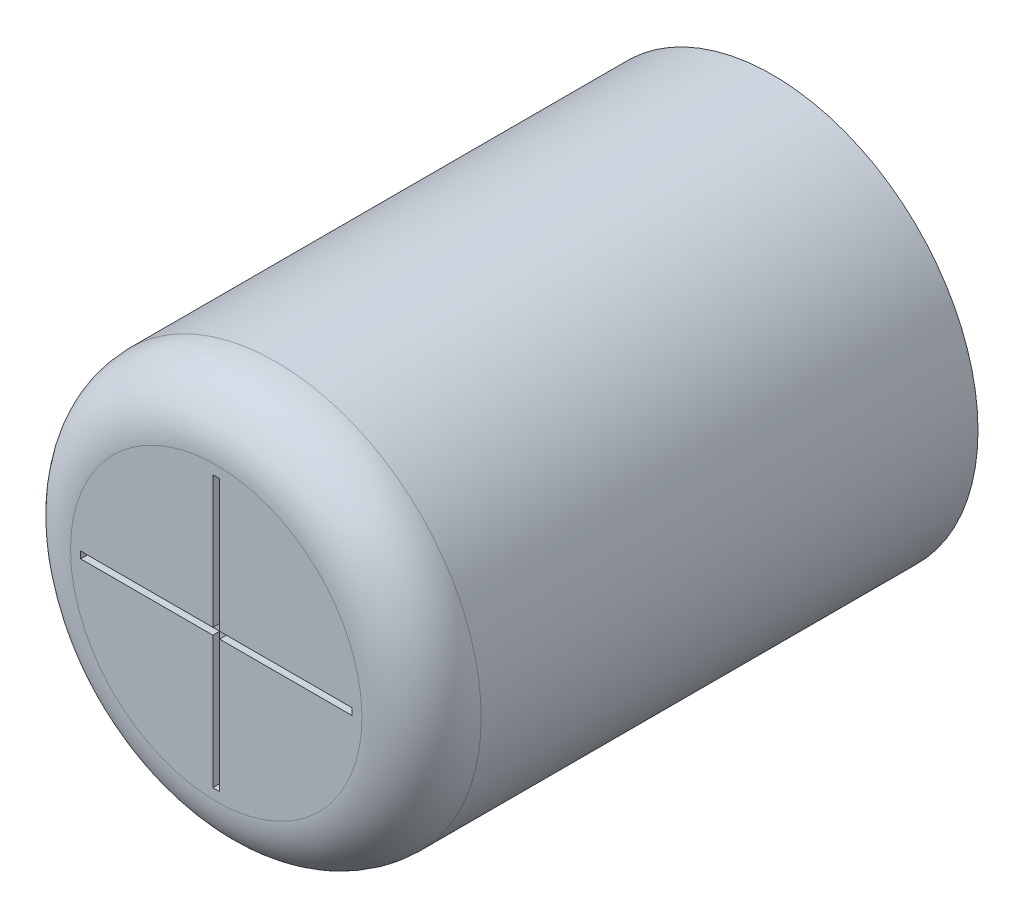
ISO-10303-21;
HEADER;
FILE_DESCRIPTION(('STEP AP214'),'2;1');
FILE_NAME('part.step','',(''),(''),'','','');
FILE_SCHEMA(('AUTOMOTIVE_DESIGN { 1 0 10303 214 1 1 1 1 }'));
ENDSEC;
DATA;
#1=APPLICATION_CONTEXT('core data for automotive mechanical design processes');
#2=APPLICATION_PROTOCOL_DEFINITION('international standard','automotive_design',2000,#1);
#3=PRODUCT_CONTEXT('',#1,'mechanical');
#4=PRODUCT('Part','Part','',(#3));
#5=PRODUCT_RELATED_PRODUCT_CATEGORY('part','',(#4));
#6=PRODUCT_DEFINITION_FORMATION('','',#4);
#7=PRODUCT_DEFINITION_CONTEXT('part definition',#1,'design');
#8=PRODUCT_DEFINITION('design','',#6,#7);
#9=PRODUCT_DEFINITION_SHAPE('','',#8);
#10=(LENGTH_UNIT() NAMED_UNIT(*) SI_UNIT(.MILLI.,.METRE.));
#11=(NAMED_UNIT(*) PLANE_ANGLE_UNIT() SI_UNIT($,.RADIAN.));
#12=(NAMED_UNIT(*) SI_UNIT($,.STERADIAN.) SOLID_ANGLE_UNIT());
#13=UNCERTAINTY_MEASURE_WITH_UNIT(LENGTH_MEASURE(1.E-05),#10,'distance_accuracy_value','');
#14=(GEOMETRIC_REPRESENTATION_CONTEXT(3) GLOBAL_UNCERTAINTY_ASSIGNED_CONTEXT((#13)) GLOBAL_UNIT_ASSIGNED_CONTEXT((#10,
#11,#12)) REPRESENTATION_CONTEXT('',''));
#15=CARTESIAN_POINT('',(0.,0.,0.));
#16=DIRECTION('',(0.,0.,1.));
#17=DIRECTION('',(1.,0.,0.));
#18=AXIS2_PLACEMENT_3D('',#15,#16,#17);
#19=CARTESIAN_POINT('',(-102.183303397109,-58.0021041199526,5.27999999850933));
#20=DIRECTION('',(0.,0.,1.));
#21=DIRECTION('',(1.,0.,0.));
#22=AXIS2_PLACEMENT_3D('',#19,#20,#21);
#23=PLANE('',#22);
#24=DIRECTION('',(0.,1.,0.));
#25=VECTOR('',#24,1.);
#26=CARTESIAN_POINT('',(-102.133303397109,-57.9521041199526,5.27999999850933));
#27=LINE('',#26,#25);
#28=CARTESIAN_POINT('',(-102.133303397109,-57.9521041199526,5.27999999850933));
#29=VERTEX_POINT('',#28);
#30=CARTESIAN_POINT('',(-102.133303397109,-56.0021041199526,5.27999999850933));
#31=VERTEX_POINT('',#30);
#32=EDGE_CURVE('E377',#29,#31,#27,.T.);
#33=ORIENTED_EDGE('',*,*,#32,.T.);
#34=DIRECTION('',(1.,0.,0.));
#35=VECTOR('',#34,1.);
#36=CARTESIAN_POINT('',(-102.133303397109,-56.0021041199526,5.27999999850933));
#37=LINE('',#36,#35);
#38=CARTESIAN_POINT('',(-102.233303397109,-56.0021041199526,5.27999999850933));
#39=VERTEX_POINT('',#38);
#40=EDGE_CURVE('E381',#31,#39,#37,.F.);
#41=ORIENTED_EDGE('',*,*,#40,.T.);
#42=DIRECTION('',(0.,1.,0.));
#43=VECTOR('',#42,1.);
#44=CARTESIAN_POINT('',(-102.233303397109,-56.0021041199526,5.27999999850933));
#45=LINE('',#44,#43);
#46=CARTESIAN_POINT('',(-102.233303397109,-57.9521041199526,5.27999999850933));
#47=VERTEX_POINT('',#46);
#48=EDGE_CURVE('E385',#39,#47,#45,.F.);
#49=ORIENTED_EDGE('',*,*,#48,.T.);
#50=DIRECTION('',(1.,0.,0.));
#51=VECTOR('',#50,1.);
#52=CARTESIAN_POINT('',(-102.233303397109,-57.9521041199526,5.27999999850933));
#53=LINE('',#52,#51);
#54=CARTESIAN_POINT('',(-104.183303397109,-57.9521041199526,5.27999999850933));
#55=VERTEX_POINT('',#54);
#56=EDGE_CURVE('E388',#47,#55,#53,.F.);
#57=ORIENTED_EDGE('',*,*,#56,.T.);
#58=DIRECTION('',(0.,1.,0.));
#59=VECTOR('',#58,1.);
#60=CARTESIAN_POINT('',(-104.183303397109,-57.9521041199526,5.27999999850933));
#61=LINE('',#60,#59);
#62=CARTESIAN_POINT('',(-104.183303397109,-58.0521041199526,5.27999999850933));
#63=VERTEX_POINT('',#62);
#64=EDGE_CURVE('E120',#55,#63,#61,.F.);
#65=ORIENTED_EDGE('',*,*,#64,.T.);
#66=DIRECTION('',(1.,0.,0.));
#67=VECTOR('',#66,1.);
#68=CARTESIAN_POINT('',(-104.183303397109,-58.0521041199526,5.27999999850933));
#69=LINE('',#68,#67);
#70=CARTESIAN_POINT('',(-102.233303397109,-58.0521041199526,5.27999999850933));
#71=VERTEX_POINT('',#70);
#72=EDGE_CURVE('E123',#63,#71,#69,.T.);
#73=ORIENTED_EDGE('',*,*,#72,.T.);
#74=DIRECTION('',(0.,1.,0.));
#75=VECTOR('',#74,1.);
#76=CARTESIAN_POINT('',(-102.233303397109,-58.0521041199526,5.27999999850933));
#77=LINE('',#76,#75);
#78=CARTESIAN_POINT('',(-102.233303397109,-60.0021041199526,5.27999999850933));
#79=VERTEX_POINT('',#78);
#80=EDGE_CURVE('E125',#71,#79,#77,.F.);
#81=ORIENTED_EDGE('',*,*,#80,.T.);
#82=DIRECTION('',(1.,0.,0.));
#83=VECTOR('',#82,1.);
#84=CARTESIAN_POINT('',(-102.183303397109,-60.0021041199526,5.27999999850933));
#85=LINE('',#84,#83);
#86=CARTESIAN_POINT('',(-102.133303397109,-60.0021041199526,5.27999999850933));
#87=VERTEX_POINT('',#86);
#88=EDGE_CURVE('E137',#79,#87,#85,.T.);
#89=ORIENTED_EDGE('',*,*,#88,.T.);
#90=DIRECTION('',(0.,1.,0.));
#91=VECTOR('',#90,1.);
#92=CARTESIAN_POINT('',(-102.133303397109,-60.0021041199526,5.27999999850933));
#93=LINE('',#92,#91);
#94=CARTESIAN_POINT('',(-102.133303397109,-58.0521041199526,5.27999999850933));
#95=VERTEX_POINT('',#94);
#96=EDGE_CURVE('E361',#87,#95,#93,.T.);
#97=ORIENTED_EDGE('',*,*,#96,.T.);
#98=DIRECTION('',(1.,0.,0.));
#99=VECTOR('',#98,1.);
#100=CARTESIAN_POINT('',(-102.133303397109,-58.0521041199526,5.27999999850933));
#101=LINE('',#100,#99);
#102=CARTESIAN_POINT('',(-100.183303397109,-58.0521041199526,5.27999999850933));
#103=VERTEX_POINT('',#102);
#104=EDGE_CURVE('E365',#95,#103,#101,.T.);
#105=ORIENTED_EDGE('',*,*,#104,.T.);
#106=DIRECTION('',(0.,1.,0.));
#107=VECTOR('',#106,1.);
#108=CARTESIAN_POINT('',(-100.183303397109,-58.0521041199526,5.27999999850933));
#109=LINE('',#108,#107);
#110=CARTESIAN_POINT('',(-100.183303397109,-57.9521041199526,5.27999999850933));
#111=VERTEX_POINT('',#110);
#112=EDGE_CURVE('E369',#103,#111,#109,.T.);
#113=ORIENTED_EDGE('',*,*,#112,.T.);
#114=DIRECTION('',(1.,0.,0.));
#115=VECTOR('',#114,1.);
#116=CARTESIAN_POINT('',(-100.183303397109,-57.9521041199526,5.27999999850933));
#117=LINE('',#116,#115);
#118=EDGE_CURVE('E373',#111,#29,#117,.F.);
#119=ORIENTED_EDGE('',*,*,#118,.T.);
#120=EDGE_LOOP('',(#33,#41,#49,#57,#65,#73,#81,#89,#97,#105,#113,#119));
#121=FACE_BOUND('',#120,.T.);
#122=ADVANCED_FACE('F17',(#121),#23,.T.);
#123=CARTESIAN_POINT('',(-102.233303397109,-58.0521041199526,5.37999999999944));
#124=DIRECTION('',(-1.,0.,0.));
#125=DIRECTION('',(0.,0.,1.));
#126=AXIS2_PLACEMENT_3D('',#123,#124,#125);
#127=PLANE('',#126);
#128=DIRECTION('',(0.,1.,0.));
#129=VECTOR('',#128,1.);
#130=CARTESIAN_POINT('',(-102.233303397109,-58.0021041199525,5.3799999999994));
#131=LINE('',#130,#129);
#132=CARTESIAN_POINT('',(-102.233303397109,-60.0021041199526,5.37999999999942));
#133=VERTEX_POINT('',#132);
#134=CARTESIAN_POINT('',(-102.233303397109,-58.0521041199526,5.37999999999942));
#135=VERTEX_POINT('',#134);
#136=EDGE_CURVE('E352',#133,#135,#131,.T.);
#137=ORIENTED_EDGE('',*,*,#136,.F.);
#138=DIRECTION('',(0.,0.,-1.));
#139=VECTOR('',#138,1.);
#140=CARTESIAN_POINT('',(-102.233303397109,-60.0021041199526,5.37999999999944));
#141=LINE('',#140,#139);
#142=EDGE_CURVE('E136',#133,#79,#141,.T.);
#143=ORIENTED_EDGE('',*,*,#142,.T.);
#144=ORIENTED_EDGE('',*,*,#80,.F.);
#145=DIRECTION('',(0.,0.,-1.));
#146=VECTOR('',#145,1.);
#147=CARTESIAN_POINT('',(-102.233303397109,-58.0521041199526,5.37999999999944));
#148=LINE('',#147,#146);
#149=EDGE_CURVE('E130',#71,#135,#148,.F.);
#150=ORIENTED_EDGE('',*,*,#149,.T.);
#151=EDGE_LOOP('',(#137,#143,#144,#150));
#152=FACE_BOUND('',#151,.T.);
#153=ADVANCED_FACE('F133',(#152),#127,.F.);
#154=CARTESIAN_POINT('',(-104.183303397109,-58.0521041199526,5.37999999999944));
#155=DIRECTION('',(0.,-1.,0.));
#156=DIRECTION('',(0.,0.,-1.));
#157=AXIS2_PLACEMENT_3D('',#154,#155,#156);
#158=PLANE('',#157);
#159=DIRECTION('',(1.,0.,0.));
#160=VECTOR('',#159,1.);
#161=CARTESIAN_POINT('',(-101.108303397109,-58.0521041199526,5.3799999999994));
#162=LINE('',#161,#160);
#163=CARTESIAN_POINT('',(-104.183303397109,-58.0521041199526,5.37999999999942));
#164=VERTEX_POINT('',#163);
#165=EDGE_CURVE('E141',#135,#164,#162,.F.);
#166=ORIENTED_EDGE('',*,*,#165,.F.);
#167=ORIENTED_EDGE('',*,*,#149,.F.);
#168=ORIENTED_EDGE('',*,*,#72,.F.);
#169=DIRECTION('',(0.,0.,1.));
#170=VECTOR('',#169,1.);
#171=CARTESIAN_POINT('',(-104.183303397109,-58.0521041199526,5.37999999999944));
#172=LINE('',#171,#170);
#173=EDGE_CURVE('E144',#63,#164,#172,.T.);
#174=ORIENTED_EDGE('',*,*,#173,.T.);
#175=EDGE_LOOP('',(#166,#167,#168,#174));
#176=FACE_BOUND('',#175,.T.);
#177=ADVANCED_FACE('F139',(#176),#158,.F.);
#178=CARTESIAN_POINT('',(-104.183303397109,-57.9521041199526,5.37999999999944));
#179=DIRECTION('',(-1.,0.,0.));
#180=DIRECTION('',(0.,0.,1.));
#181=AXIS2_PLACEMENT_3D('',#178,#179,#180);
#182=PLANE('',#181);
#183=DIRECTION('',(0.,1.,0.));
#184=VECTOR('',#183,1.);
#185=CARTESIAN_POINT('',(-104.183303397109,-58.0021041199525,5.3799999999994));
#186=LINE('',#185,#184);
#187=CARTESIAN_POINT('',(-104.183303397109,-57.9521041199526,5.37999999999942));
#188=VERTEX_POINT('',#187);
#189=EDGE_CURVE('E343',#164,#188,#186,.T.);
#190=ORIENTED_EDGE('',*,*,#189,.F.);
#191=ORIENTED_EDGE('',*,*,#173,.F.);
#192=ORIENTED_EDGE('',*,*,#64,.F.);
#193=DIRECTION('',(0.,0.,1.));
#194=VECTOR('',#193,1.);
#195=CARTESIAN_POINT('',(-104.183303397109,-57.9521041199526,5.37999999999944));
#196=LINE('',#195,#194);
#197=EDGE_CURVE('E345',#55,#188,#196,.T.);
#198=ORIENTED_EDGE('',*,*,#197,.T.);
#199=EDGE_LOOP('',(#190,#191,#192,#198));
#200=FACE_BOUND('',#199,.T.);
#201=ADVANCED_FACE('F302',(#200),#182,.F.);
#202=CARTESIAN_POINT('',(-102.233303397109,-57.9521041199526,5.37999999999944));
#203=DIRECTION('',(0.,1.,0.));
#204=DIRECTION('',(0.,0.,1.));
#205=AXIS2_PLACEMENT_3D('',#202,#203,#204);
#206=PLANE('',#205);
#207=DIRECTION('',(1.,0.,0.));
#208=VECTOR('',#207,1.);
#209=CARTESIAN_POINT('',(-101.108303397109,-57.9521041199526,5.3799999999994));
#210=LINE('',#209,#208);
#211=CARTESIAN_POINT('',(-102.233303397109,-57.9521041199526,5.37999999999942));
#212=VERTEX_POINT('',#211);
#213=EDGE_CURVE('E348',#188,#212,#210,.T.);
#214=ORIENTED_EDGE('',*,*,#213,.F.);
#215=ORIENTED_EDGE('',*,*,#197,.F.);
#216=ORIENTED_EDGE('',*,*,#56,.F.);
#217=DIRECTION('',(0.,0.,1.));
#218=VECTOR('',#217,1.);
#219=CARTESIAN_POINT('',(-102.233303397109,-57.9521041199526,5.37999999999944));
#220=LINE('',#219,#218);
#221=EDGE_CURVE('E383',#47,#212,#220,.T.);
#222=ORIENTED_EDGE('',*,*,#221,.T.);
#223=EDGE_LOOP('',(#214,#215,#216,#222));
#224=FACE_BOUND('',#223,.T.);
#225=ADVANCED_FACE('F292',(#224),#206,.F.);
#226=CARTESIAN_POINT('',(-102.233303397109,-56.0021041199526,5.37999999999944));
#227=DIRECTION('',(-1.,0.,0.));
#228=DIRECTION('',(0.,0.,1.));
#229=AXIS2_PLACEMENT_3D('',#226,#227,#228);
#230=PLANE('',#229);
#231=DIRECTION('',(0.,1.,0.));
#232=VECTOR('',#231,1.);
#233=CARTESIAN_POINT('',(-102.233303397109,-58.0021041199525,5.3799999999994));
#234=LINE('',#233,#232);
#235=CARTESIAN_POINT('',(-102.233303397109,-56.0021041199526,5.37999999999942));
#236=VERTEX_POINT('',#235);
#237=EDGE_CURVE('E394',#212,#236,#234,.T.);
#238=ORIENTED_EDGE('',*,*,#237,.F.);
#239=ORIENTED_EDGE('',*,*,#221,.F.);
#240=ORIENTED_EDGE('',*,*,#48,.F.);
#241=DIRECTION('',(0.,0.,1.));
#242=VECTOR('',#241,1.);
#243=CARTESIAN_POINT('',(-102.233303397109,-56.0021041199526,5.37999999999944));
#244=LINE('',#243,#242);
#245=EDGE_CURVE('E379',#39,#236,#244,.T.);
#246=ORIENTED_EDGE('',*,*,#245,.T.);
#247=EDGE_LOOP('',(#238,#239,#240,#246));
#248=FACE_BOUND('',#247,.T.);
#249=ADVANCED_FACE('F282',(#248),#230,.F.);
#250=CARTESIAN_POINT('',(-102.133303397109,-56.0021041199526,5.37999999999944));
#251=DIRECTION('',(0.,1.,0.));
#252=DIRECTION('',(0.,0.,1.));
#253=AXIS2_PLACEMENT_3D('',#250,#251,#252);
#254=PLANE('',#253);
#255=DIRECTION('',(1.,0.,0.));
#256=VECTOR('',#255,1.);
#257=CARTESIAN_POINT('',(-101.108303397109,-56.0021041199526,5.3799999999994));
#258=LINE('',#257,#256);
#259=CARTESIAN_POINT('',(-102.133303397109,-56.0021041199526,5.37999999999942));
#260=VERTEX_POINT('',#259);
#261=EDGE_CURVE('E395',#236,#260,#258,.T.);
#262=ORIENTED_EDGE('',*,*,#261,.F.);
#263=ORIENTED_EDGE('',*,*,#245,.F.);
#264=ORIENTED_EDGE('',*,*,#40,.F.);
#265=DIRECTION('',(0.,0.,-1.));
#266=VECTOR('',#265,1.);
#267=CARTESIAN_POINT('',(-102.133303397109,-56.0021041199526,5.37999999999944));
#268=LINE('',#267,#266);
#269=EDGE_CURVE('E375',#31,#260,#268,.F.);
#270=ORIENTED_EDGE('',*,*,#269,.T.);
#271=EDGE_LOOP('',(#262,#263,#264,#270));
#272=FACE_BOUND('',#271,.T.);
#273=ADVANCED_FACE('F272',(#272),#254,.F.);
#274=CARTESIAN_POINT('',(-102.133303397109,-57.9521041199526,5.37999999999944));
#275=DIRECTION('',(1.,0.,0.));
#276=DIRECTION('',(0.,0.,-1.));
#277=AXIS2_PLACEMENT_3D('',#274,#275,#276);
#278=PLANE('',#277);
#279=DIRECTION('',(0.,1.,0.));
#280=VECTOR('',#279,1.);
#281=CARTESIAN_POINT('',(-102.133303397109,-58.0021041199525,5.3799999999994));
#282=LINE('',#281,#280);
#283=CARTESIAN_POINT('',(-102.133303397109,-57.9521041199526,5.37999999999942));
#284=VERTEX_POINT('',#283);
#285=EDGE_CURVE('E400',#260,#284,#282,.F.);
#286=ORIENTED_EDGE('',*,*,#285,.F.);
#287=ORIENTED_EDGE('',*,*,#269,.F.);
#288=ORIENTED_EDGE('',*,*,#32,.F.);
#289=DIRECTION('',(0.,0.,1.));
#290=VECTOR('',#289,1.);
#291=CARTESIAN_POINT('',(-102.133303397109,-57.9521041199526,5.37999999999944));
#292=LINE('',#291,#290);
#293=EDGE_CURVE('E371',#29,#284,#292,.T.);
#294=ORIENTED_EDGE('',*,*,#293,.T.);
#295=EDGE_LOOP('',(#286,#287,#288,#294));
#296=FACE_BOUND('',#295,.T.);
#297=ADVANCED_FACE('F262',(#296),#278,.F.);
#298=CARTESIAN_POINT('',(-100.183303397109,-57.9521041199526,5.37999999999944));
#299=DIRECTION('',(0.,1.,0.));
#300=DIRECTION('',(0.,0.,1.));
#301=AXIS2_PLACEMENT_3D('',#298,#299,#300);
#302=PLANE('',#301);
#303=DIRECTION('',(1.,0.,0.));
#304=VECTOR('',#303,1.);
#305=CARTESIAN_POINT('',(-101.108303397109,-57.9521041199526,5.3799999999994));
#306=LINE('',#305,#304);
#307=CARTESIAN_POINT('',(-100.183303397109,-57.9521041199526,5.37999999999942));
#308=VERTEX_POINT('',#307);
#309=EDGE_CURVE('E403',#284,#308,#306,.T.);
#310=ORIENTED_EDGE('',*,*,#309,.F.);
#311=ORIENTED_EDGE('',*,*,#293,.F.);
#312=ORIENTED_EDGE('',*,*,#118,.F.);
#313=DIRECTION('',(0.,0.,-1.));
#314=VECTOR('',#313,1.);
#315=CARTESIAN_POINT('',(-100.183303397109,-57.9521041199526,5.37999999999944));
#316=LINE('',#315,#314);
#317=EDGE_CURVE('E367',#111,#308,#316,.F.);
#318=ORIENTED_EDGE('',*,*,#317,.T.);
#319=EDGE_LOOP('',(#310,#311,#312,#318));
#320=FACE_BOUND('',#319,.T.);
#321=ADVANCED_FACE('F252',(#320),#302,.F.);
#322=CARTESIAN_POINT('',(-100.183303397109,-58.0521041199526,5.37999999999944));
#323=DIRECTION('',(1.,0.,0.));
#324=DIRECTION('',(0.,0.,-1.));
#325=AXIS2_PLACEMENT_3D('',#322,#323,#324);
#326=PLANE('',#325);
#327=DIRECTION('',(0.,1.,0.));
#328=VECTOR('',#327,1.);
#329=CARTESIAN_POINT('',(-100.183303397109,-58.0021041199525,5.3799999999994));
#330=LINE('',#329,#328);
#331=CARTESIAN_POINT('',(-100.183303397109,-58.0521041199526,5.37999999999942));
#332=VERTEX_POINT('',#331);
#333=EDGE_CURVE('E406',#308,#332,#330,.F.);
#334=ORIENTED_EDGE('',*,*,#333,.F.);
#335=ORIENTED_EDGE('',*,*,#317,.F.);
#336=ORIENTED_EDGE('',*,*,#112,.F.);
#337=DIRECTION('',(0.,0.,-1.));
#338=VECTOR('',#337,1.);
#339=CARTESIAN_POINT('',(-100.183303397109,-58.0521041199526,5.37999999999944));
#340=LINE('',#339,#338);
#341=EDGE_CURVE('E363',#103,#332,#340,.F.);
#342=ORIENTED_EDGE('',*,*,#341,.T.);
#343=EDGE_LOOP('',(#334,#335,#336,#342));
#344=FACE_BOUND('',#343,.T.);
#345=ADVANCED_FACE('F242',(#344),#326,.F.);
#346=CARTESIAN_POINT('',(-102.133303397109,-58.0521041199526,5.37999999999944));
#347=DIRECTION('',(0.,-1.,0.));
#348=DIRECTION('',(0.,0.,-1.));
#349=AXIS2_PLACEMENT_3D('',#346,#347,#348);
#350=PLANE('',#349);
#351=DIRECTION('',(1.,0.,0.));
#352=VECTOR('',#351,1.);
#353=CARTESIAN_POINT('',(-101.108303397109,-58.0521041199526,5.3799999999994));
#354=LINE('',#353,#352);
#355=CARTESIAN_POINT('',(-102.133303397109,-58.0521041199526,5.37999999999942));
#356=VERTEX_POINT('',#355);
#357=EDGE_CURVE('E409',#332,#356,#354,.F.);
#358=ORIENTED_EDGE('',*,*,#357,.F.);
#359=ORIENTED_EDGE('',*,*,#341,.F.);
#360=ORIENTED_EDGE('',*,*,#104,.F.);
#361=DIRECTION('',(0.,0.,-1.));
#362=VECTOR('',#361,1.);
#363=CARTESIAN_POINT('',(-102.133303397109,-58.0521041199526,5.37999999999944));
#364=LINE('',#363,#362);
#365=EDGE_CURVE('E359',#95,#356,#364,.F.);
#366=ORIENTED_EDGE('',*,*,#365,.T.);
#367=EDGE_LOOP('',(#358,#359,#360,#366));
#368=FACE_BOUND('',#367,.T.);
#369=ADVANCED_FACE('F233',(#368),#350,.F.);
#370=CARTESIAN_POINT('',(-102.133303397109,-60.0021041199526,5.37999999999944));
#371=DIRECTION('',(1.,0.,0.));
#372=DIRECTION('',(0.,0.,-1.));
#373=AXIS2_PLACEMENT_3D('',#370,#371,#372);
#374=PLANE('',#373);
#375=DIRECTION('',(0.,1.,0.));
#376=VECTOR('',#375,1.);
#377=CARTESIAN_POINT('',(-102.133303397109,-58.0021041199525,5.3799999999994));
#378=LINE('',#377,#376);
#379=CARTESIAN_POINT('',(-102.133303397109,-60.0021041199526,5.37999999999942));
#380=VERTEX_POINT('',#379);
#381=EDGE_CURVE('E412',#356,#380,#378,.F.);
#382=ORIENTED_EDGE('',*,*,#381,.F.);
#383=ORIENTED_EDGE('',*,*,#365,.F.);
#384=ORIENTED_EDGE('',*,*,#96,.F.);
#385=DIRECTION('',(0.,0.,-1.));
#386=VECTOR('',#385,1.);
#387=CARTESIAN_POINT('',(-102.133303397109,-60.0021041199526,5.37999999999944));
#388=LINE('',#387,#386);
#389=EDGE_CURVE('E51',#87,#380,#388,.F.);
#390=ORIENTED_EDGE('',*,*,#389,.T.);
#391=EDGE_LOOP('',(#382,#383,#384,#390));
#392=FACE_BOUND('',#391,.T.);
#393=ADVANCED_FACE('F223',(#392),#374,.F.);
#394=CARTESIAN_POINT('',(-102.233303397109,-60.0021041199526,5.37999999999944));
#395=DIRECTION('',(0.,-1.,0.));
#396=DIRECTION('',(0.,0.,-1.));
#397=AXIS2_PLACEMENT_3D('',#394,#395,#396);
#398=PLANE('',#397);
#399=DIRECTION('',(1.,0.,0.));
#400=VECTOR('',#399,1.);
#401=CARTESIAN_POINT('',(-101.108303397109,-60.0021041199526,5.3799999999994));
#402=LINE('',#401,#400);
#403=EDGE_CURVE('E152',#380,#133,#402,.F.);
#404=ORIENTED_EDGE('',*,*,#403,.F.);
#405=ORIENTED_EDGE('',*,*,#389,.F.);
#406=ORIENTED_EDGE('',*,*,#88,.F.);
#407=ORIENTED_EDGE('',*,*,#142,.F.);
#408=EDGE_LOOP('',(#404,#405,#406,#407));
#409=FACE_BOUND('',#408,.T.);
#410=ADVANCED_FACE('F186',(#409),#398,.F.);
#411=CARTESIAN_POINT('',(-101.108303397109,-58.0021041199525,5.3799999999994));
#412=DIRECTION('',(0.,0.,1.));
#413=DIRECTION('',(1.,0.,0.));
#414=AXIS2_PLACEMENT_3D('',#411,#412,#413);
#415=PLANE('',#414);
#416=ORIENTED_EDGE('',*,*,#381,.T.);
#417=ORIENTED_EDGE('',*,*,#403,.T.);
#418=ORIENTED_EDGE('',*,*,#136,.T.);
#419=ORIENTED_EDGE('',*,*,#165,.T.);
#420=ORIENTED_EDGE('',*,*,#189,.T.);
#421=ORIENTED_EDGE('',*,*,#213,.T.);
#422=ORIENTED_EDGE('',*,*,#237,.T.);
#423=ORIENTED_EDGE('',*,*,#261,.T.);
#424=ORIENTED_EDGE('',*,*,#285,.T.);
#425=ORIENTED_EDGE('',*,*,#309,.T.);
#426=ORIENTED_EDGE('',*,*,#333,.T.);
#427=ORIENTED_EDGE('',*,*,#357,.T.);
#428=EDGE_LOOP('',(#416,#417,#418,#419,#420,#421,#422,#423,#424,#425,#426,#427));
#429=FACE_BOUND('',#428,.T.);
#430=CARTESIAN_POINT('',(-102.183303397109,-60.1521041199525,5.37999999999941));
#431=CARTESIAN_POINT('',(-102.216244550873,-60.1521046937376,5.37999999999941));
#432=CARTESIAN_POINT('',(-102.249185658923,-60.1513470813821,5.37999999999941));
#433=CARTESIAN_POINT('',(-102.314998316302,-60.1483196040844,5.37999999999941));
#434=CARTESIAN_POINT('',(-102.34786986563,-60.1460497391421,5.37999999999941));
#435=CARTESIAN_POINT('',(-102.413473938266,-60.1400018763654,5.37999999999941));
#436=CARTESIAN_POINT('',(-102.446206461574,-60.1362238785308,5.37999999999941));
#437=CARTESIAN_POINT('',(-102.511463347914,-60.1271679113026,5.37999999999941));
#438=CARTESIAN_POINT('',(-102.543987710946,-60.121889941909,5.37999999999941));
#439=CARTESIAN_POINT('',(-102.608759571641,-60.1098451320384,5.37999999999941));
#440=CARTESIAN_POINT('',(-102.641007069304,-60.1030782915614,5.37999999999941));
#441=CARTESIAN_POINT('',(-102.705157081812,-60.0880700463803,5.37999999999941));
#442=CARTESIAN_POINT('',(-102.737059596656,-60.0798286416761,5.37999999999941));
#443=CARTESIAN_POINT('',(-102.800452254123,-60.0618886735688,5.37999999999941));
#444=CARTESIAN_POINT('',(-102.831942396747,-60.0521901101656,5.37999999999941));
#445=CARTESIAN_POINT('',(-102.894443791344,-60.0313563113566,5.37999999999941));
#446=CARTESIAN_POINT('',(-102.925455043318,-60.0202210759509,5.3799999999994));
#447=CARTESIAN_POINT('',(-102.986933150855,-59.9965374581626,5.37999999999942));
#448=CARTESIAN_POINT('',(-103.017400006418,-59.9839890757799,5.37999999999944));
#449=CARTESIAN_POINT('',(-103.077724961104,-59.957505656693,5.37999999999939));
#450=CARTESIAN_POINT('',(-103.107583060225,-59.9435706199886,5.37999999999932));
#451=CARTESIAN_POINT('',(-103.166627443723,-59.9143433801711,5.3799999999995));
#452=CARTESIAN_POINT('',(-103.1958137281,-59.8990511770579,5.37999999999974));
#453=CARTESIAN_POINT('',(-103.25345278386,-59.8671417119514,5.37999999999908));
#454=CARTESIAN_POINT('',(-103.281905555244,-59.850524449958,5.37999999999819));
#455=CARTESIAN_POINT('',(-103.338017656594,-59.8160006962353,5.38000000000063));
#456=CARTESIAN_POINT('',(-103.365676986559,-59.7980942045059,5.38000000000397));
#457=CARTESIAN_POINT('',(-103.420143130191,-59.7610271004523,5.37999999999485));
#458=CARTESIAN_POINT('',(-103.446949943858,-59.7418664881281,5.37999999998241));
#459=CARTESIAN_POINT('',(-103.491224700835,-59.7086649930553,5.38000000001098));
#460=CARTESIAN_POINT('',(-103.508936348349,-59.6949475845787,5.38000000003616));
#461=CARTESIAN_POINT('',(-103.543929042527,-59.6669732456587,5.37999999977829));
#462=CARTESIAN_POINT('',(-103.561210085317,-59.6527163103659,5.37999999949523));
#463=CARTESIAN_POINT('',(-103.595323868589,-59.6236751153626,5.37999999755365));
#464=CARTESIAN_POINT('',(-103.612156599655,-59.6088908445938,5.3799999958951));
#465=CARTESIAN_POINT('',(-103.645358172561,-59.5788096440277,5.37999998916964));
#466=CARTESIAN_POINT('',(-103.661726999085,-59.563512697342,5.37999998410263));
#467=CARTESIAN_POINT('',(-103.702049625444,-59.5246457950661,5.3799999648461));
#468=CARTESIAN_POINT('',(-103.725703586106,-59.5007636670096,5.37999994736204));
#469=CARTESIAN_POINT('',(-103.771887118909,-59.4519302447685,5.37999988392375));
#470=CARTESIAN_POINT('',(-103.794416584672,-59.4269788498448,5.37999983796684));
#471=CARTESIAN_POINT('',(-103.823650632521,-59.3930355438285,5.37999975891332));
#472=CARTESIAN_POINT('',(-103.830887750098,-59.3844987107582,5.37999973768308));
#473=CARTESIAN_POINT('',(-103.845221901092,-59.3673077219131,5.37999969965425));
#474=CARTESIAN_POINT('',(-103.852318930745,-59.3586535629953,5.37999968285578));
#475=CARTESIAN_POINT('',(-103.873399172716,-59.3325205458734,5.3799996391097));
#476=CARTESIAN_POINT('',(-103.887171677922,-59.3148709849185,5.37999961881097));
#477=CARTESIAN_POINT('',(-103.914137927826,-59.279135568662,5.37999960273092));
#478=CARTESIAN_POINT('',(-103.927331671159,-59.2610497123323,5.37999960694964));
#479=CARTESIAN_POINT('',(-103.953127046126,-59.2244612662134,5.37999963846735));
#480=CARTESIAN_POINT('',(-103.965728696609,-59.2059586897188,5.37999966576559));
#481=CARTESIAN_POINT('',(-103.99032515282,-59.1685563496886,5.37999973574551));
#482=CARTESIAN_POINT('',(-104.002319998588,-59.1496566124774,5.37999977842617));
#483=CARTESIAN_POINT('',(-104.025693637461,-59.1114823780719,5.37999986497066));
#484=CARTESIAN_POINT('',(-104.037072492231,-59.0922079186538,5.37999990883437));
#485=CARTESIAN_POINT('',(-104.059188395745,-59.0532978799458,5.37999997604549));
#486=CARTESIAN_POINT('',(-104.06992553062,-59.0336623495828,5.37999999939565));
#487=CARTESIAN_POINT('',(-104.091892980822,-58.9920003622577,5.38000000066646));
#488=CARTESIAN_POINT('',(-104.103057003705,-58.9699390444306,5.37999997356818));
#489=CARTESIAN_POINT('',(-104.124706902873,-58.9254878604865,5.3799999394719));
#490=CARTESIAN_POINT('',(-104.135192836805,-58.9030980224977,5.37999993247221));
#491=CARTESIAN_POINT('',(-104.15289938787,-58.8636280807954,5.37999994962803));
#492=CARTESIAN_POINT('',(-104.160281021068,-58.846619736564,5.37999996643304));
#493=CARTESIAN_POINT('',(-104.174705271633,-58.8124558944734,5.37999998972842));
#494=CARTESIAN_POINT('',(-104.181747857592,-58.795300383154,5.37999999621784));
#495=CARTESIAN_POINT('',(-104.192517792783,-58.7676248863544,5.37999999923079));
#496=CARTESIAN_POINT('',(-104.196448247964,-58.7571838669131,5.37999999869444));
#497=CARTESIAN_POINT('',(-104.211711468068,-58.7157171588636,5.37999999757058));
#498=CARTESIAN_POINT('',(-104.222448412806,-58.6844687274039,5.37999999894458));
#499=CARTESIAN_POINT('',(-104.238297783918,-58.634556633227,5.37999999978011));
#500=CARTESIAN_POINT('',(-104.243896734552,-58.6160458783878,5.37999999979831));
#501=CARTESIAN_POINT('',(-104.255563457182,-58.5755176200284,5.37999999989398));
#502=CARTESIAN_POINT('',(-104.261532697261,-58.5534717466224,5.37999999998157));
#503=CARTESIAN_POINT('',(-104.276542808331,-58.4943146620694,5.38000000002925));
#504=CARTESIAN_POINT('',(-104.284950545933,-58.4570399797116,5.37999999986402));
#505=CARTESIAN_POINT('',(-104.296066878754,-58.4008382456044,5.37999999965431));
#506=CARTESIAN_POINT('',(-104.299523221971,-58.382055272012,5.37999999959076));
#507=CARTESIAN_POINT('',(-104.305935263143,-58.3444035998246,5.37999999948441));
#508=CARTESIAN_POINT('',(-104.308890962265,-58.3255349014294,5.3799999994416));
#509=CARTESIAN_POINT('',(-104.315200953913,-58.2814240560139,5.37999999938464));
#510=CARTESIAN_POINT('',(-104.318359749831,-58.2561537510199,5.37999999938478));
#511=CARTESIAN_POINT('',(-104.323779439004,-58.2055172252865,5.37999999944959));
#512=CARTESIAN_POINT('',(-104.326040331142,-58.180151004428,5.37999999951426));
#513=CARTESIAN_POINT('',(-104.329661345362,-58.1293542505861,5.37999999967592));
#514=CARTESIAN_POINT('',(-104.331021464085,-58.1039237173632,5.3799999997729));
#515=CARTESIAN_POINT('',(-104.332839511665,-58.0530300783677,5.37999999993481));
#516=CARTESIAN_POINT('',(-104.333297434914,-58.0275669723936,5.37999999999975));
#517=CARTESIAN_POINT('',(-104.333308104221,-57.9820013731439,5.37999999999914));
#518=CARTESIAN_POINT('',(-104.333031104285,-57.9618987843622,5.37999999995819));
#519=CARTESIAN_POINT('',(-104.331913125668,-57.9217096085909,5.37999999980241));
#520=CARTESIAN_POINT('',(-104.33107214326,-57.9016230217078,5.37999999968758));
#521=CARTESIAN_POINT('',(-104.327704219927,-57.8414107215904,5.37999999924529));
#522=CARTESIAN_POINT('',(-104.324332303632,-57.8013288862494,5.37999999882005));
#523=CARTESIAN_POINT('',(-104.315345763263,-57.7214193755265,5.37999999777173));
#524=CARTESIAN_POINT('',(-104.309731112837,-57.6815917031366,5.37999999714866));
#525=CARTESIAN_POINT('',(-104.296276706195,-57.6023128921063,5.37999999576266));
#526=CARTESIAN_POINT('',(-104.288436926014,-57.5628617575262,5.37999999499973));
#527=CARTESIAN_POINT('',(-104.270556909209,-57.4844610943297,5.37999999338693));
#528=CARTESIAN_POINT('',(-104.26051665104,-57.4455115706287,5.37999999253706));
#529=CARTESIAN_POINT('',(-104.238267253051,-57.3682365831565,5.37999999079826));
#530=CARTESIAN_POINT('',(-104.22605809412,-57.3299111248879,5.37999998990933));
#531=CARTESIAN_POINT('',(-104.199509307306,-57.2540050367779,5.37999998813526));
#532=CARTESIAN_POINT('',(-104.185169662736,-57.2164244127732,5.37999998725011));
#533=CARTESIAN_POINT('',(-104.154405031068,-57.1421263419565,5.37999998552139));
#534=CARTESIAN_POINT('',(-104.137980029678,-57.1054089010624,5.37999998467782));
#535=CARTESIAN_POINT('',(-104.103096383189,-57.032952846978,5.37999998306502));
#536=CARTESIAN_POINT('',(-104.084637726143,-56.9972142395394,5.37999998229579));
#537=CARTESIAN_POINT('',(-104.045744876405,-56.926828414535,5.37999998085939));
#538=CARTESIAN_POINT('',(-104.025310674041,-56.8921812023132,5.37999998019222));
#539=CARTESIAN_POINT('',(-103.982531067885,-56.8240872933947,5.37999997898262));
#540=CARTESIAN_POINT('',(-103.960185656609,-56.7906406014005,5.37999997844019));
#541=CARTESIAN_POINT('',(-103.913653990195,-56.725053076116,5.37999997749771));
#542=CARTESIAN_POINT('',(-103.889467729652,-56.6929122466618,5.37999997709767));
#543=CARTESIAN_POINT('',(-103.839330523823,-56.6300376754466,5.37999997645255));
#544=CARTESIAN_POINT('',(-103.813379575083,-56.5993039364412,5.37999997620748));
#545=CARTESIAN_POINT('',(-103.759794713423,-56.5393403415665,5.37999997587988));
#546=CARTESIAN_POINT('',(-103.732160798855,-56.5101104871698,5.37999997579735));
#547=CARTESIAN_POINT('',(-103.675297029892,-56.453246718206,5.37999997579735));
#548=CARTESIAN_POINT('',(-103.646067175495,-56.4256128036387,5.37999997587988));
#549=CARTESIAN_POINT('',(-103.58610358062,-56.3720279419787,5.37999997620748));
#550=CARTESIAN_POINT('',(-103.555369841614,-56.3460769932381,5.37999997645255));
#551=CARTESIAN_POINT('',(-103.492495270401,-56.2959397874099,5.37999997709767));
#552=CARTESIAN_POINT('',(-103.46035444095,-56.2717535268667,5.37999997749771));
#553=CARTESIAN_POINT('',(-103.394766915656,-56.2252218604523,5.37999997844019));
#554=CARTESIAN_POINT('',(-103.361320223648,-56.2028764491739,5.37999997898262));
#555=CARTESIAN_POINT('',(-103.293226314767,-56.1600968430235,5.37999998019222));
#556=CARTESIAN_POINT('',(-103.258579102595,-56.1396626406665,5.37999998085939));
#557=CARTESIAN_POINT('',(-103.188193277453,-56.1007697909085,5.37999998229579));
#558=CARTESIAN_POINT('',(-103.152454669827,-56.0823111338362,5.37999998306502));
#559=CARTESIAN_POINT('',(-103.079998616255,-56.0474274874197,5.37999998467782));
#560=CARTESIAN_POINT('',(-103.043281176061,-56.0310024861286,5.37999998552139));
#561=CARTESIAN_POINT('',(-102.968983103332,-56.000237854191,5.37999998725011));
#562=CARTESIAN_POINT('',(-102.931402476715,-55.985898209252,5.37999998813526));
#563=CARTESIAN_POINT('',(-102.855496395742,-55.9593494234455,5.37999998990933));
#564=CARTESIAN_POINT('',(-102.817170947223,-55.94714026589,5.37999999079826));
#565=CARTESIAN_POINT('',(-102.739895933115,-55.9248908641422,5.37999999253706));
#566=CARTESIAN_POINT('',(-102.700946373028,-55.9148506008374,5.37999999338693));
#567=CARTESIAN_POINT('',(-102.622545809238,-55.8969705980631,5.37999999499973));
#568=CARTESIAN_POINT('',(-102.583094810448,-55.8891308370476,5.37999999576268));
#569=CARTESIAN_POINT('',(-102.503815628434,-55.8756763780438,5.37999999714864));
#570=CARTESIAN_POINT('',(-102.463987449276,-55.8700616560901,5.37999999777166));
#571=CARTESIAN_POINT('',(-102.384079323063,-55.861075311136,5.37999999882011));
#572=CARTESIAN_POINT('',(-102.343999378972,-55.8577036617792,5.37999999924554));
#573=CARTESIAN_POINT('',(-102.263714037637,-55.8532125298379,5.37999999983474));
#574=CARTESIAN_POINT('',(-102.223508641995,-55.8520930185845,5.37999999999851));
#575=CARTESIAN_POINT('',(-102.183303397109,-55.8521041199525,5.37999999999941));
#576=B_SPLINE_CURVE_WITH_KNOTS('',3,(#430,#431,#432,#433,#434,#435,#436,#437,#438,#439,#440,
#441,#442,#443,#444,#445,#446,#447,#448,#449,#450,#451,#452,#453,#454,#455,#456,#457,#458,#459,
#460,#461,#462,#463,#464,#465,#466,#467,#468,#469,#470,#471,#472,#473,#474,#475,#476,#477,#478,
#479,#480,#481,#482,#483,#484,#485,#486,#487,#488,#489,#490,#491,#492,#493,#494,#495,#496,#497,
#498,#499,#500,#501,#502,#503,#504,#505,#506,#507,#508,#509,#510,#511,#512,#513,#514,#515,#516,
#517,#518,#519,#520,#521,#522,#523,#524,#525,#526,#527,#528,#529,#530,#531,#532,#533,#534,#535,
#536,#537,#538,#539,#540,#541,#542,#543,#544,#545,#546,#547,#548,#549,#550,#551,#552,#553,#554,
#555,#556,#557,#558,#559,#560,#561,#562,#563,#564,#565,#566,#567,#568,#569,#570,#571,#572,#573,
#574,#575),.UNSPECIFIED.,.F.,.F.,(4,2,2,2,2,2,2,2,2,2,2,2,2,2,2,2,2,2,2,2,2,2,2,2,2,2,2,2,2,2,2,
2,2,2,2,2,2,2,2,2,2,2,2,2,2,2,2,2,2,2,2,2,2,2,2,2,2,2,2,2,2,2,2,2,2,2,2,2,2,2,2,2,4),(0.,
0.0988146853601754,0.197629370720352,0.296444056080528,0.395258741440705,0.494073426800888,
0.592888112161071,0.691702797521243,0.790517482881431,0.889332168241601,0.988146853601778,
1.08696153896196,1.18577622432213,1.28459090968231,1.38340559504249,1.45060316387927,
1.51780133684256,1.58500091979231,1.65220271857998,1.75300632866038,1.85381945673137,
1.88739341367888,1.92096827179109,1.98811734535884,2.05526657718708,2.12241366978341,
2.18955632573409,2.25669224772187,2.32381913854434,2.3979828895618,2.47214032725736,
2.52776057086394,2.58338595702659,2.61685340950853,2.71593842869586,2.77394903525205,
2.84245812274195,2.95702822309229,3.01431797779548,3.0716075989568,3.14799194034829,
3.22437637670069,3.30076109793579,3.3771462939754,3.43745188069091,3.49775786601135,
3.61835910394213,3.73896175899568,3.85956571307844,3.98017084809687,4.10077704595737,
4.22138418856641,4.34199215783041,4.46260083565581,4.58321010394905,4.70381984461655,
4.82442993956474,4.94504027070007,5.06565071992897,5.18626116915786,5.30687150029319,
5.42748159524139,5.54809133590889,5.66870060420212,5.78930928202752,5.90991725129153,
6.03052439390056,6.15113059176108,6.27173572677949,6.39233968086225,6.5129423359158,
6.63354357384658,6.75414327656103),.UNSPECIFIED.);
#577=CARTESIAN_POINT('',(-102.183303532149,-60.1521041199525,5.3799999999994));
#578=VERTEX_POINT('',#577);
#579=CARTESIAN_POINT('',(-102.183304297103,-55.8521041197329,5.3799999999994));
#580=VERTEX_POINT('',#579);
#581=EDGE_CURVE('E43',#578,#580,#576,.T.);
#582=ORIENTED_EDGE('',*,*,#581,.F.);
#583=CARTESIAN_POINT('',(-100.033303397109,-58.0021041199525,5.37999999999941));
#584=CARTESIAN_POINT('',(-100.033303249605,-58.0255569864555,5.37999999999941));
#585=CARTESIAN_POINT('',(-100.033687138388,-58.0490098445948,5.37999999999941));
#586=CARTESIAN_POINT('',(-100.035221929682,-58.0958904514438,5.37999999999941));
#587=CARTESIAN_POINT('',(-100.036372832193,-58.1193182001535,5.37999999999941));
#588=CARTESIAN_POINT('',(-100.039440592099,-58.1661234954411,5.37999999999941));
#589=CARTESIAN_POINT('',(-100.041357449492,-58.189501042019,5.37999999999941));
#590=CARTESIAN_POINT('',(-100.045955020035,-58.2361809013031,5.37999999999941));
#591=CARTESIAN_POINT('',(-100.048635733185,-58.2594832140093,5.37999999999941));
#592=CARTESIAN_POINT('',(-100.054758157126,-58.3059876524419,5.37999999999941));
#593=CARTESIAN_POINT('',(-100.058199867918,-58.3291897781684,5.37999999999941));
#594=CARTESIAN_POINT('',(-100.065840598335,-58.3754689973334,5.37999999999941));
#595=CARTESIAN_POINT('',(-100.07003961796,-58.398546090772,5.37999999999941));
#596=CARTESIAN_POINT('',(-100.079190470524,-58.4445505338024,5.37999999999941));
#597=CARTESIAN_POINT('',(-100.084142303462,-58.4674778833942,5.37999999999941));
#598=CARTESIAN_POINT('',(-100.094793479864,-58.5131582875586,5.37999999999941));
#599=CARTESIAN_POINT('',(-100.100492823328,-58.5359113421313,5.37999999999941));
#600=CARTESIAN_POINT('',(-100.112632917847,-58.5812187917146,5.37999999999941));
#601=CARTESIAN_POINT('',(-100.119073668902,-58.6037731867252,5.37999999999941));
#602=CARTESIAN_POINT('',(-100.132689681668,-58.648659165374,5.37999999999941));
#603=CARTESIAN_POINT('',(-100.139864943378,-58.6709907490121,5.37999999999941));
#604=CARTESIAN_POINT('',(-100.154942294011,-58.7154071916965,5.37999999999941));
#605=CARTESIAN_POINT('',(-100.162844382932,-58.7374920507429,5.37999999999941));
#606=CARTESIAN_POINT('',(-100.17936692623,-58.7813913952234,5.37999999999941));
#607=CARTESIAN_POINT('',(-100.187987380606,-58.8032058806577,5.37999999999941));
#608=CARTESIAN_POINT('',(-100.205937423814,-58.8465411184172,5.37999999999941));
#609=CARTESIAN_POINT('',(-100.215267012646,-58.8680618707425,5.37999999999941));
#610=CARTESIAN_POINT('',(-100.234625334411,-58.9107865973214,5.37999999999941));
#611=CARTESIAN_POINT('',(-100.244654067344,-58.9319905715751,5.37999999999941));
#612=CARTESIAN_POINT('',(-100.265399938284,-58.9740590362715,5.37999999999941));
#613=CARTESIAN_POINT('',(-100.276117076292,-58.9949235267142,5.37999999999941));
#614=CARTESIAN_POINT('',(-100.298228281228,-59.0362906815426,5.37999999999941));
#615=CARTESIAN_POINT('',(-100.309622348157,-59.0567933459282,5.37999999999941));
#616=CARTESIAN_POINT('',(-100.333075209788,-59.0974148939768,5.37999999999941));
#617=CARTESIAN_POINT('',(-100.345134004489,-59.1175337776398,5.37999999999941));
#618=CARTESIAN_POINT('',(-100.369903409164,-59.1573662200618,5.37999999999941));
#619=CARTESIAN_POINT('',(-100.382614019138,-59.1770797788207,5.37999999999941));
#620=CARTESIAN_POINT('',(-100.40867344218,-59.2160804630686,5.37999999999941));
#621=CARTESIAN_POINT('',(-100.422022255248,-59.2353675885576,5.37999999999943));
#622=CARTESIAN_POINT('',(-100.449343795226,-59.273494747879,5.3799999999994));
#623=CARTESIAN_POINT('',(-100.463316522134,-59.2923347817114,5.37999999999936));
#624=CARTESIAN_POINT('',(-100.491870908832,-59.3295476029311,5.37999999999946));
#625=CARTESIAN_POINT('',(-100.506452568621,-59.3479203903183,5.3799999999996));
#626=CARTESIAN_POINT('',(-100.536209276137,-59.3841789714904,5.37999999999922));
#627=CARTESIAN_POINT('',(-100.551384323864,-59.4020647652753,5.3799999999987));
#628=CARTESIAN_POINT('',(-100.582311298195,-59.43733047956,5.38000000000013));
#629=CARTESIAN_POINT('',(-100.598063224798,-59.4547104000597,5.38000000000208));
#630=CARTESIAN_POINT('',(-100.630128056819,-59.4889447385437,5.37999999999674));
#631=CARTESIAN_POINT('',(-100.646440962236,-59.505799156528,5.37999999998945));
#632=CARTESIAN_POINT('',(-100.680282069536,-59.5396437078708,5.38000000000977));
#633=CARTESIAN_POINT('',(-100.697832708588,-59.5566114102871,5.38000000003882));
#634=CARTESIAN_POINT('',(-100.733495026784,-59.5899468935885,5.37999999976194));
#635=CARTESIAN_POINT('',(-100.751606711584,-59.6063146684231,5.37999999945601));
#636=CARTESIAN_POINT('',(-100.788371919367,-59.6384308026872,5.37999999737377));
#637=CARTESIAN_POINT('',(-100.807025454528,-59.6541791481758,5.37999999559744));
#638=CARTESIAN_POINT('',(-100.844852914813,-59.6850393362784,5.37999998835812));
#639=CARTESIAN_POINT('',(-100.864026858077,-59.7001511566573,5.379999982895));
#640=CARTESIAN_POINT('',(-100.902874608486,-59.7297198840073,5.37999996639917));
#641=CARTESIAN_POINT('',(-100.922548439237,-59.7441767599595,5.37999995536619));
#642=CARTESIAN_POINT('',(-100.962370561876,-59.7724242635978,5.37999992084191));
#643=CARTESIAN_POINT('',(-100.982518882027,-59.7862148514448,5.37999989734987));
#644=CARTESIAN_POINT('',(-101.023254990261,-59.8130793537225,5.37999984598817));
#645=CARTESIAN_POINT('',(-101.043842246942,-59.8261540731963,5.37999981812356));
#646=CARTESIAN_POINT('',(-101.085466003108,-59.851569151555,5.37999978101088));
#647=CARTESIAN_POINT('',(-101.106502515428,-59.86390948942,5.37999977176335));
#648=CARTESIAN_POINT('',(-101.148994484492,-59.8878462592975,5.37999977226362));
#649=CARTESIAN_POINT('',(-101.170449938291,-59.8994426965354,5.37999978201129));
#650=CARTESIAN_POINT('',(-101.213755014153,-59.9218714983223,5.37999981729467));
#651=CARTESIAN_POINT('',(-101.235604619364,-59.9327038954436,5.3799998428297));
#652=CARTESIAN_POINT('',(-101.279664242805,-59.9536067606787,5.37999990075138));
#653=CARTESIAN_POINT('',(-101.301874232684,-59.9636772883791,5.37999993313749));
#654=CARTESIAN_POINT('',(-101.346648118828,-59.9829860387571,5.37999997961287));
#655=CARTESIAN_POINT('',(-101.369211974483,-59.9922243561307,5.37999999370423));
#656=CARTESIAN_POINT('',(-101.422090314477,-60.0130249045032,5.38000000837637));
#657=CARTESIAN_POINT('',(-101.452500326631,-60.0243453464759,5.38000000294825));
#658=CARTESIAN_POINT('',(-101.516647250174,-60.0465443514973,5.37999999455756));
#659=CARTESIAN_POINT('',(-101.550432090915,-60.0572856075971,5.37999999186893));
#660=CARTESIAN_POINT('',(-101.608854149384,-60.0742948352715,5.37999997968542));
#661=CARTESIAN_POINT('',(-101.633374567183,-60.0809685248279,5.37999997233185));
#662=CARTESIAN_POINT('',(-101.679740161813,-60.092697497534,5.37999995943075));
#663=CARTESIAN_POINT('',(-101.701560469463,-60.097850815425,5.37999995377251));
#664=CARTESIAN_POINT('',(-101.742430955578,-60.1068210113761,5.37999994615816));
#665=CARTESIAN_POINT('',(-101.761462211697,-60.1107244623913,5.37999994380876));
#666=CARTESIAN_POINT('',(-101.802653274806,-60.1185839488138,5.37999994193743));
#667=CARTESIAN_POINT('',(-101.824830314103,-60.1224500372431,5.37999994292331));
#668=CARTESIAN_POINT('',(-101.869295201949,-60.1294788863384,5.37999994665152));
#669=CARTESIAN_POINT('',(-101.8915830496,-60.132641652695,5.37999994939383));
#670=CARTESIAN_POINT('',(-101.936247472247,-60.1382591530937,5.3799999566777));
#671=CARTESIAN_POINT('',(-101.95862404574,-60.1407138990832,5.37999996121924));
#672=CARTESIAN_POINT('',(-102.003443126672,-60.1449133125492,5.37999997100638));
#673=CARTESIAN_POINT('',(-102.025885632404,-60.1466579982444,5.37999997625197));
#674=CARTESIAN_POINT('',(-102.07081388438,-60.1494354146628,5.37999998616017));
#675=CARTESIAN_POINT('',(-102.093299629108,-60.1504681699067,5.37999999082279));
#676=CARTESIAN_POINT('',(-102.138291574441,-60.1518208999669,5.37999999770657));
#677=CARTESIAN_POINT('',(-102.16079777412,-60.1521409055948,5.37999999992784));
#678=CARTESIAN_POINT('',(-102.183303397109,-60.1521041199525,5.37999999999941));
#679=B_SPLINE_CURVE_WITH_KNOTS('',3,(#583,#584,#585,#586,#587,#588,#589,#590,#591,#592,#593,
#594,#595,#596,#597,#598,#599,#600,#601,#602,#603,#604,#605,#606,#607,#608,#609,#610,#611,#612,
#613,#614,#615,#616,#617,#618,#619,#620,#621,#622,#623,#624,#625,#626,#627,#628,#629,#630,#631,
#632,#633,#634,#635,#636,#637,#638,#639,#640,#641,#642,#643,#644,#645,#646,#647,#648,#649,#650,
#651,#652,#653,#654,#655,#656,#657,#658,#659,#660,#661,#662,#663,#664,#665,#666,#667,#668,#669,
#670,#671,#672,#673,#674,#675,#676,#677,#678),.UNSPECIFIED.,.F.,.F.,(4,2,2,2,2,2,2,2,2,2,2,2,2,
2,2,2,2,2,2,2,2,2,2,2,2,2,2,2,2,2,2,2,2,2,2,2,2,2,2,2,2,2,2,2,2,2,2,4),(0.,0.070355445993893,
0.140710891987787,0.211066337981678,0.281421783975574,0.351777229969471,0.422132675963365,
0.492488121957254,0.562843567951149,0.633199013945041,0.703554459938934,0.773909905932832,
0.844265351926723,0.914620797920615,0.984976243914508,1.0553316899084,1.1256871359023,
1.19604258189619,1.26639802789008,1.33675347388398,1.40710891987787,1.47746436587177,
1.54781981186566,1.61817525785955,1.68853070385344,1.76175162940606,1.83497329322453,
1.90819660404488,1.98142247059545,2.05465180159621,2.12788550575796,2.20103508665469,
2.27418676026444,2.34733791998318,2.42048595926518,2.49362827164129,2.56676225073743,
2.66408128654459,2.77038592101473,2.84660865537427,2.91385858138949,2.97213399695047,
3.03965678830633,3.10717903331041,3.17470013885482,3.24221951183452,3.30973655914762,
3.3772506876957),.UNSPECIFIED.);
#680=CARTESIAN_POINT('',(-100.033303397109,-58.002104390032,5.37999999999941));
#681=VERTEX_POINT('',#680);
#682=EDGE_CURVE('E35',#681,#578,#679,.T.);
#683=ORIENTED_EDGE('',*,*,#682,.F.);
#684=CARTESIAN_POINT('',(-102.183303397109,-55.8521041199525,5.37999999999941));
#685=CARTESIAN_POINT('',(-102.159850530606,-55.8521039724481,5.37999999999941));
#686=CARTESIAN_POINT('',(-102.136397672467,-55.8524878612311,5.37999999999941));
#687=CARTESIAN_POINT('',(-102.089517065618,-55.8540226525255,5.37999999999941));
#688=CARTESIAN_POINT('',(-102.066089316908,-55.8551735550369,5.37999999999941));
#689=CARTESIAN_POINT('',(-102.01928402162,-55.8582413149421,5.37999999999941));
#690=CARTESIAN_POINT('',(-101.995906475042,-55.8601581723358,5.37999999999941));
#691=CARTESIAN_POINT('',(-101.949226615758,-55.8647557428788,5.37999999999941));
#692=CARTESIAN_POINT('',(-101.925924303052,-55.8674364560282,5.37999999999941));
#693=CARTESIAN_POINT('',(-101.87941986462,-55.8735588799695,5.37999999999941));
#694=CARTESIAN_POINT('',(-101.856217738893,-55.8770005907614,5.37999999999941));
#695=CARTESIAN_POINT('',(-101.809938519728,-55.8846413211786,5.37999999999941));
#696=CARTESIAN_POINT('',(-101.78686142629,-55.8888403408039,5.37999999999941));
#697=CARTESIAN_POINT('',(-101.740856983259,-55.8979911933672,5.37999999999941));
#698=CARTESIAN_POINT('',(-101.717929633667,-55.9029430263052,5.37999999999941));
#699=CARTESIAN_POINT('',(-101.672249229503,-55.9135942027073,5.37999999999941));
#700=CARTESIAN_POINT('',(-101.64949617493,-55.9192935461715,5.37999999999941));
#701=CARTESIAN_POINT('',(-101.604188725347,-55.9314336406905,5.37999999999941));
#702=CARTESIAN_POINT('',(-101.581634330336,-55.9378743917454,5.37999999999941));
#703=CARTESIAN_POINT('',(-101.536748351688,-55.9514904045111,5.37999999999941));
#704=CARTESIAN_POINT('',(-101.514416768049,-55.9586656662219,5.37999999999941));
#705=CARTESIAN_POINT('',(-101.470000325365,-55.9737430168541,5.37999999999941));
#706=CARTESIAN_POINT('',(-101.447915466319,-55.9816451057755,5.37999999999941));
#707=CARTESIAN_POINT('',(-101.404016121838,-55.998167649073,5.37999999999941));
#708=CARTESIAN_POINT('',(-101.382201636404,-56.0067881034491,5.37999999999941));
#709=CARTESIAN_POINT('',(-101.338866398644,-56.0247381466574,5.37999999999941));
#710=CARTESIAN_POINT('',(-101.317345646319,-56.0340677354896,5.37999999999941));
#711=CARTESIAN_POINT('',(-101.27462091974,-56.0534260572544,5.37999999999941));
#712=CARTESIAN_POINT('',(-101.253416945486,-56.063454790187,5.37999999999941));
#713=CARTESIAN_POINT('',(-101.21134848079,-56.0842006611274,5.37999999999941));
#714=CARTESIAN_POINT('',(-101.190483990347,-56.0949177991352,5.37999999999941));
#715=CARTESIAN_POINT('',(-101.149116835519,-56.1170290040719,5.37999999999941));
#716=CARTESIAN_POINT('',(-101.128614171133,-56.1284230710007,5.37999999999941));
#717=CARTESIAN_POINT('',(-101.087992623085,-56.1518759326312,5.37999999999941));
#718=CARTESIAN_POINT('',(-101.067873739422,-56.1639347273329,5.37999999999941));
#719=CARTESIAN_POINT('',(-101.028041297,-56.1887041320078,5.37999999999941));
#720=CARTESIAN_POINT('',(-101.008327738241,-56.201414741981,5.37999999999941));
#721=CARTESIAN_POINT('',(-100.969327053993,-56.2274741650231,5.37999999999941));
#722=CARTESIAN_POINT('',(-100.950039928504,-56.2408229780919,5.37999999999943));
#723=CARTESIAN_POINT('',(-100.911912769183,-56.2681445180691,5.3799999999994));
#724=CARTESIAN_POINT('',(-100.89307273535,-56.2821172449775,5.37999999999936));
#725=CARTESIAN_POINT('',(-100.85585991413,-56.3106716316752,5.37999999999946));
#726=CARTESIAN_POINT('',(-100.837487126743,-56.3252532914646,5.3799999999996));
#727=CARTESIAN_POINT('',(-100.801228545571,-56.3550099989807,5.37999999999922));
#728=CARTESIAN_POINT('',(-100.783342751786,-56.3701850467074,5.3799999999987));
#729=CARTESIAN_POINT('',(-100.748077037502,-56.401112021038,5.38000000000013));
#730=CARTESIAN_POINT('',(-100.730697117002,-56.4168639476419,5.38000000000208));
#731=CARTESIAN_POINT('',(-100.696462778518,-56.4489287796624,5.37999999999674));
#732=CARTESIAN_POINT('',(-100.679608360533,-56.4652416850791,5.37999999998945));
#733=CARTESIAN_POINT('',(-100.645763809191,-56.4990827923797,5.38000000000977));
#734=CARTESIAN_POINT('',(-100.628796106774,-56.5166334314309,5.38000000003882));
#735=CARTESIAN_POINT('',(-100.595460623473,-56.5522957496274,5.37999999976194));
#736=CARTESIAN_POINT('',(-100.579092848639,-56.5704074344276,5.37999999945601));
#737=CARTESIAN_POINT('',(-100.546976714375,-56.6071726422105,5.37999999737377));
#738=CARTESIAN_POINT('',(-100.531228368886,-56.6258261773718,5.37999999559744));
#739=CARTESIAN_POINT('',(-100.500368180784,-56.6636536376566,5.37999998835812));
#740=CARTESIAN_POINT('',(-100.485256360405,-56.6828275809208,5.379999982895));
#741=CARTESIAN_POINT('',(-100.455687633056,-56.7216753313298,5.37999996639917));
#742=CARTESIAN_POINT('',(-100.441230757104,-56.7413491620813,5.37999995536619));
#743=CARTESIAN_POINT('',(-100.412983253466,-56.7811712847201,5.37999992084191));
#744=CARTESIAN_POINT('',(-100.39919266562,-56.8013196048715,5.37999989734988));
#745=CARTESIAN_POINT('',(-100.372328163342,-56.8420557131055,5.37999984598817));
#746=CARTESIAN_POINT('',(-100.359253443869,-56.8626429697873,5.37999981812356));
#747=CARTESIAN_POINT('',(-100.333838365511,-56.9042667259536,5.37999978101089));
#748=CARTESIAN_POINT('',(-100.321498027646,-56.9253032382735,5.37999977176335));
#749=CARTESIAN_POINT('',(-100.297561257768,-56.9677952073368,5.37999977226363));
#750=CARTESIAN_POINT('',(-100.28596482053,-56.989250661136,5.3799997820113));
#751=CARTESIAN_POINT('',(-100.263536018743,-57.0325557369984,5.37999981729467));
#752=CARTESIAN_POINT('',(-100.252703621621,-57.0544053422084,5.3799998428297));
#753=CARTESIAN_POINT('',(-100.231800756386,-57.0984649656492,5.37999990075138));
#754=CARTESIAN_POINT('',(-100.221730228685,-57.1206749555285,5.37999993313749));
#755=CARTESIAN_POINT('',(-100.202421478306,-57.1654488416719,5.37999997961287));
#756=CARTESIAN_POINT('',(-100.193183160931,-57.1880126973262,5.37999999370423));
#757=CARTESIAN_POINT('',(-100.172382612536,-57.2408910373759,5.38000000837637));
#758=CARTESIAN_POINT('',(-100.161062170545,-57.2713010495855,5.38000000294825));
#759=CARTESIAN_POINT('',(-100.138863165529,-57.335447973129,5.37999999455756));
#760=CARTESIAN_POINT('',(-100.128121909448,-57.3692328138109,5.37999999186893));
#761=CARTESIAN_POINT('',(-100.111112682352,-57.4276548702892,5.37999997968542));
#762=CARTESIAN_POINT('',(-100.10443899329,-57.4521752861366,5.37999997233185));
#763=CARTESIAN_POINT('',(-100.092710020947,-57.4985408787833,5.37999995943075));
#764=CARTESIAN_POINT('',(-100.087556702996,-57.5203611864184,5.37999995377251));
#765=CARTESIAN_POINT('',(-100.078586506497,-57.5612316744728,5.37999994615816));
#766=CARTESIAN_POINT('',(-100.074683055049,-57.5802629325564,5.37999994380876));
#767=CARTESIAN_POINT('',(-100.066823568245,-57.6214539976414,5.37999994193742));
#768=CARTESIAN_POINT('',(-100.062957479812,-57.643631036938,5.37999994292331));
#769=CARTESIAN_POINT('',(-100.055928630711,-57.6880959247837,5.37999994665152));
#770=CARTESIAN_POINT('',(-100.052765864352,-57.7103837724349,5.37999994939383));
#771=CARTESIAN_POINT('',(-100.047148363951,-57.7550481950833,5.3799999566777));
#772=CARTESIAN_POINT('',(-100.044693617961,-57.7774247685768,5.37999996121924));
#773=CARTESIAN_POINT('',(-100.040494204495,-57.8222438495099,5.37999997100638));
#774=CARTESIAN_POINT('',(-100.0387495188,-57.8446863552429,5.37999997625197));
#775=CARTESIAN_POINT('',(-100.035972102385,-57.8896146072205,5.37999998616016));
#776=CARTESIAN_POINT('',(-100.034939347143,-57.9121003519492,5.37999999082279));
#777=CARTESIAN_POINT('',(-100.033586617087,-57.9570922972837,5.37999999770657));
#778=CARTESIAN_POINT('',(-100.033266611463,-57.9795984969632,5.37999999992784));
#779=CARTESIAN_POINT('',(-100.033303397109,-58.0021041199525,5.37999999999941));
#780=B_SPLINE_CURVE_WITH_KNOTS('',3,(#684,#685,#686,#687,#688,#689,#690,#691,#692,#693,#694,
#695,#696,#697,#698,#699,#700,#701,#702,#703,#704,#705,#706,#707,#708,#709,#710,#711,#712,#713,
#714,#715,#716,#717,#718,#719,#720,#721,#722,#723,#724,#725,#726,#727,#728,#729,#730,#731,#732,
#733,#734,#735,#736,#737,#738,#739,#740,#741,#742,#743,#744,#745,#746,#747,#748,#749,#750,#751,
#752,#753,#754,#755,#756,#757,#758,#759,#760,#761,#762,#763,#764,#765,#766,#767,#768,#769,#770,
#771,#772,#773,#774,#775,#776,#777,#778,#779),.UNSPECIFIED.,.F.,.F.,(4,2,2,2,2,2,2,2,2,2,2,2,2,
2,2,2,2,2,2,2,2,2,2,2,2,2,2,2,2,2,2,2,2,2,2,2,2,2,2,2,2,2,2,2,2,2,2,4),(0.,0.0703554459939,
0.140710891987787,0.211066337981678,0.281421783975567,0.351777229969462,0.422132675963364,
0.492488121957248,0.56284356795114,0.633199013945039,0.703554459938929,0.773909905932823,
0.844265351926723,0.914620797920612,0.984976243914511,1.0553316899084,1.1256871359023,
1.19604258189619,1.26639802789008,1.33675347388397,1.40710891987787,1.47746436587176,
1.54781981186566,1.61817525785954,1.68853070385344,1.76175162940593,1.83497329322426,
1.90819660404446,1.98142247059487,2.05465180159544,2.12788550575697,2.20103508665368,
2.2741867602634,2.34733791998211,2.42048595926411,2.49362827164027,2.56676225073651,
2.66408128672152,2.77038592100765,2.84660864933264,2.91385857534695,2.97213399694156,
3.03965678829907,3.10717903330502,3.17470013885139,3.24221951183302,3.30973655914791,
3.37725068769754),.UNSPECIFIED.);
#781=EDGE_CURVE('E151',#580,#681,#780,.T.);
#782=ORIENTED_EDGE('',*,*,#781,.F.);
#783=EDGE_LOOP('',(#582,#683,#782));
#784=FACE_BOUND('',#783,.T.);
#785=ADVANCED_FACE('F178',(#429,#784),#415,.T.);
#786=CARTESIAN_POINT('',(-102.183303397109,-58.0021041199525,-2.83167904083493));
#787=DIRECTION('',(0.,0.,-1.));
#788=DIRECTION('',(-1.,0.,0.));
#789=AXIS2_PLACEMENT_3D('',#786,#787,#788);
#790=PLANE('',#789);
#791=CARTESIAN_POINT('',(-102.183303397109,-58.0021041199525,-2.83167904083506));
#792=DIRECTION('',(0.,0.,1.));
#793=DIRECTION('',(1.,0.,0.));
#794=AXIS2_PLACEMENT_3D('',#791,#792,#793);
#795=CIRCLE('',#794,3.03);
#796=CARTESIAN_POINT('',(-99.153303397109,-58.0021041199525,-2.83167904083506));
#797=VERTEX_POINT('',#796);
#798=EDGE_CURVE('E22',#797,#797,#795,.T.);
#799=ORIENTED_EDGE('',*,*,#798,.F.);
#800=EDGE_LOOP('',(#799));
#801=FACE_BOUND('',#800,.T.);
#802=ADVANCED_FACE('F176',(#801),#790,.T.);
#803=CARTESIAN_POINT('',(-102.183303397109,-58.0021041199525,4.49999999999942));
#804=DIRECTION('',(0.,0.,-1.));
#805=DIRECTION('',(-1.,0.,0.));
#806=AXIS2_PLACEMENT_3D('',#803,#804,#805);
#807=TOROIDAL_SURFACE('',#806,2.15,0.879999999999988);
#808=CARTESIAN_POINT('',(-102.183303397109,-58.0021041199525,4.4999999999994));
#809=DIRECTION('',(0.,0.,1.));
#810=DIRECTION('',(1.,0.,0.));
#811=AXIS2_PLACEMENT_3D('',#808,#809,#810);
#812=CIRCLE('',#811,3.03);
#813=CARTESIAN_POINT('',(-99.153303397109,-58.0021041199525,4.4999999999994));
#814=VERTEX_POINT('',#813);
#815=EDGE_CURVE('E11',#814,#814,#812,.F.);
#816=ORIENTED_EDGE('',*,*,#815,.F.);
#817=EDGE_LOOP('',(#816));
#818=FACE_BOUND('',#817,.T.);
#819=ORIENTED_EDGE('',*,*,#781,.T.);
#820=ORIENTED_EDGE('',*,*,#682,.T.);
#821=ORIENTED_EDGE('',*,*,#581,.T.);
#822=EDGE_LOOP('',(#819,#820,#821));
#823=FACE_BOUND('',#822,.T.);
#824=ADVANCED_FACE('F19',(#818,#823),#807,.T.);
#825=CARTESIAN_POINT('',(-102.183303397109,-58.0021041199525,0.810133215711033));
#826=DIRECTION('',(0.,0.,1.));
#827=DIRECTION('',(1.,0.,0.));
#828=AXIS2_PLACEMENT_3D('',#825,#826,#827);
#829=CYLINDRICAL_SURFACE('',#828,3.03);
#830=ORIENTED_EDGE('',*,*,#815,.T.);
#831=EDGE_LOOP('',(#830));
#832=FACE_BOUND('',#831,.T.);
#833=ORIENTED_EDGE('',*,*,#798,.T.);
#834=EDGE_LOOP('',(#833));
#835=FACE_BOUND('',#834,.T.);
#836=ADVANCED_FACE('F174',(#832,#835),#829,.T.);
#837=CLOSED_SHELL('',(#122,#153,#177,#201,#225,#249,#273,#297,#321,#345,#369,#393,#410,#785,
#802,#824,#836));
#838=MANIFOLD_SOLID_BREP('B1',#837);
#839=ADVANCED_BREP_SHAPE_REPRESENTATION('',(#18,#838),#14);
#840=SHAPE_DEFINITION_REPRESENTATION(#9,#839);
ENDSEC;
END-ISO-10303-21;
